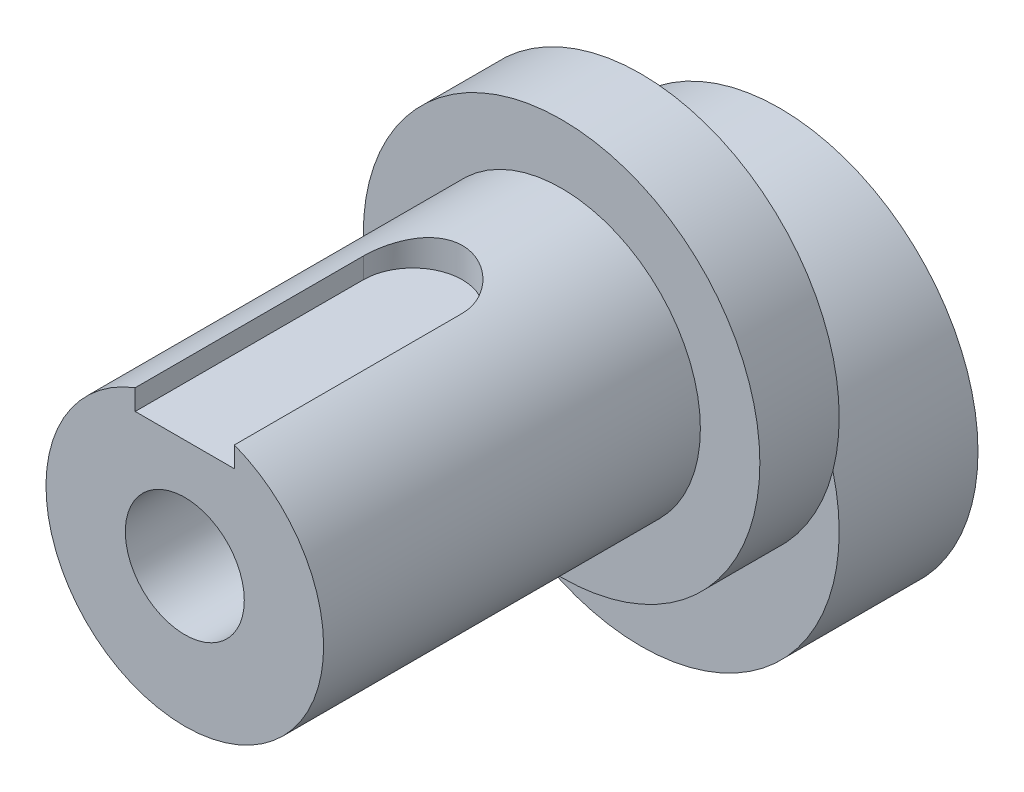
ISO-10303-21;
HEADER;
FILE_DESCRIPTION(('STEP AP214'),'2;1');
FILE_NAME('part.step','',(''),(''),'','','');
FILE_SCHEMA(('AUTOMOTIVE_DESIGN { 1 0 10303 214 1 1 1 1 }'));
ENDSEC;
DATA;
#1=APPLICATION_CONTEXT('core data for automotive mechanical design processes');
#2=APPLICATION_PROTOCOL_DEFINITION('international standard','automotive_design',2000,#1);
#3=PRODUCT_CONTEXT('',#1,'mechanical');
#4=PRODUCT('Part','Part','',(#3));
#5=PRODUCT_RELATED_PRODUCT_CATEGORY('part','',(#4));
#6=PRODUCT_DEFINITION_FORMATION('','',#4);
#7=PRODUCT_DEFINITION_CONTEXT('part definition',#1,'design');
#8=PRODUCT_DEFINITION('design','',#6,#7);
#9=PRODUCT_DEFINITION_SHAPE('','',#8);
#10=(LENGTH_UNIT() NAMED_UNIT(*) SI_UNIT(.MILLI.,.METRE.));
#11=(NAMED_UNIT(*) PLANE_ANGLE_UNIT() SI_UNIT($,.RADIAN.));
#12=(NAMED_UNIT(*) SI_UNIT($,.STERADIAN.) SOLID_ANGLE_UNIT());
#13=UNCERTAINTY_MEASURE_WITH_UNIT(LENGTH_MEASURE(1.E-05),#10,'distance_accuracy_value','');
#14=(GEOMETRIC_REPRESENTATION_CONTEXT(3) GLOBAL_UNCERTAINTY_ASSIGNED_CONTEXT((#13)) GLOBAL_UNIT_ASSIGNED_CONTEXT((#10,
#11,#12)) REPRESENTATION_CONTEXT('',''));
#15=CARTESIAN_POINT('',(0.,0.,0.));
#16=DIRECTION('',(0.,0.,1.));
#17=DIRECTION('',(1.,0.,0.));
#18=AXIS2_PLACEMENT_3D('',#15,#16,#17);
#19=CARTESIAN_POINT('',(0.,5.,11.));
#20=DIRECTION('',(0.,0.,1.));
#21=DIRECTION('',(1.,0.,0.));
#22=AXIS2_PLACEMENT_3D('',#19,#20,#21);
#23=PLANE('',#22);
#24=CARTESIAN_POINT('',(0.,5.,11.));
#25=DIRECTION('',(0.,0.,1.));
#26=DIRECTION('',(1.,0.,0.));
#27=AXIS2_PLACEMENT_3D('',#24,#25,#26);
#28=CIRCLE('',#27,10.);
#29=CARTESIAN_POINT('',(10.,5.,11.));
#30=VERTEX_POINT('',#29);
#31=EDGE_CURVE('E116',#30,#30,#28,.T.);
#32=ORIENTED_EDGE('',*,*,#31,.T.);
#33=EDGE_LOOP('',(#32));
#34=FACE_BOUND('',#33,.T.);
#35=CARTESIAN_POINT('',(0.,5.,11.));
#36=DIRECTION('',(0.,0.,1.));
#37=DIRECTION('',(1.,0.,0.));
#38=AXIS2_PLACEMENT_3D('',#35,#36,#37);
#39=CIRCLE('',#38,7.);
#40=CARTESIAN_POINT('',(7.,5.,11.));
#41=VERTEX_POINT('',#40);
#42=EDGE_CURVE('E109',#41,#41,#39,.T.);
#43=ORIENTED_EDGE('',*,*,#42,.F.);
#44=EDGE_LOOP('',(#43));
#45=FACE_BOUND('',#44,.T.);
#46=ADVANCED_FACE('F33',(#34,#45),#23,.T.);
#47=CARTESIAN_POINT('',(0.,0.,7.));
#48=DIRECTION('',(0.,0.,1.));
#49=DIRECTION('',(1.,0.,0.));
#50=AXIS2_PLACEMENT_3D('',#47,#48,#49);
#51=PLANE('',#50);
#52=CARTESIAN_POINT('',(0.,5.,7.));
#53=DIRECTION('',(0.,0.,1.));
#54=DIRECTION('',(1.,0.,0.));
#55=AXIS2_PLACEMENT_3D('',#52,#53,#54);
#56=CIRCLE('',#55,10.);
#57=CARTESIAN_POINT('',(-9.68245836551854,2.5,7.));
#58=VERTEX_POINT('',#57);
#59=CARTESIAN_POINT('',(9.68245836551854,2.5,7.));
#60=VERTEX_POINT('',#59);
#61=EDGE_CURVE('E55',#58,#60,#56,.T.);
#62=ORIENTED_EDGE('',*,*,#61,.F.);
#63=CARTESIAN_POINT('',(0.,0.,7.));
#64=DIRECTION('',(0.,0.,1.));
#65=DIRECTION('',(1.,0.,0.));
#66=AXIS2_PLACEMENT_3D('',#63,#64,#65);
#67=CIRCLE('',#66,10.);
#68=EDGE_CURVE('E128',#58,#60,#67,.T.);
#69=ORIENTED_EDGE('',*,*,#68,.T.);
#70=EDGE_LOOP('',(#62,#69));
#71=FACE_BOUND('',#70,.T.);
#72=ADVANCED_FACE('F164',(#71),#51,.T.);
#73=CARTESIAN_POINT('',(0.,0.,0.));
#74=DIRECTION('',(0.,0.,1.));
#75=DIRECTION('',(1.,0.,0.));
#76=AXIS2_PLACEMENT_3D('',#73,#74,#75);
#77=PLANE('',#76);
#78=CARTESIAN_POINT('',(0.,0.,0.));
#79=DIRECTION('',(0.,0.,1.));
#80=DIRECTION('',(1.,0.,0.));
#81=AXIS2_PLACEMENT_3D('',#78,#79,#80);
#82=CIRCLE('',#81,10.);
#83=CARTESIAN_POINT('',(10.,0.,0.));
#84=VERTEX_POINT('',#83);
#85=EDGE_CURVE('E123',#84,#84,#82,.T.);
#86=ORIENTED_EDGE('',*,*,#85,.F.);
#87=EDGE_LOOP('',(#86));
#88=FACE_BOUND('',#87,.T.);
#89=CARTESIAN_POINT('',(0.,5.,0.));
#90=DIRECTION('',(0.,0.,1.));
#91=DIRECTION('',(1.,0.,0.));
#92=AXIS2_PLACEMENT_3D('',#89,#90,#91);
#93=CIRCLE('',#92,3.);
#94=CARTESIAN_POINT('',(3.,5.,0.));
#95=VERTEX_POINT('',#94);
#96=EDGE_CURVE('E119',#95,#95,#93,.T.);
#97=ORIENTED_EDGE('',*,*,#96,.T.);
#98=EDGE_LOOP('',(#97));
#99=FACE_BOUND('',#98,.T.);
#100=ADVANCED_FACE('F169',(#88,#99),#77,.F.);
#101=CARTESIAN_POINT('',(0.,0.,7.));
#102=DIRECTION('',(0.,0.,-1.));
#103=DIRECTION('',(-1.,0.,0.));
#104=AXIS2_PLACEMENT_3D('',#101,#102,#103);
#105=CYLINDRICAL_SURFACE('',#104,10.);
#106=EDGE_CURVE('E124',#60,#58,#67,.T.);
#107=ORIENTED_EDGE('',*,*,#106,.F.);
#108=ORIENTED_EDGE('',*,*,#68,.F.);
#109=EDGE_LOOP('',(#107,#108));
#110=FACE_BOUND('',#109,.T.);
#111=ORIENTED_EDGE('',*,*,#85,.T.);
#112=EDGE_LOOP('',(#111));
#113=FACE_BOUND('',#112,.T.);
#114=ADVANCED_FACE('F35',(#110,#113),#105,.T.);
#115=CARTESIAN_POINT('',(0.,5.,7.));
#116=DIRECTION('',(0.,0.,-1.));
#117=DIRECTION('',(-1.,0.,0.));
#118=AXIS2_PLACEMENT_3D('',#115,#116,#117);
#119=CYLINDRICAL_SURFACE('',#118,3.);
#120=ORIENTED_EDGE('',*,*,#96,.F.);
#121=EDGE_LOOP('',(#120));
#122=FACE_BOUND('',#121,.T.);
#123=CARTESIAN_POINT('',(0.,5.,30.));
#124=DIRECTION('',(0.,0.,1.));
#125=DIRECTION('',(1.,0.,0.));
#126=AXIS2_PLACEMENT_3D('',#123,#124,#125);
#127=CIRCLE('',#126,3.);
#128=CARTESIAN_POINT('',(3.,5.,30.));
#129=VERTEX_POINT('',#128);
#130=EDGE_CURVE('E106',#129,#129,#127,.T.);
#131=ORIENTED_EDGE('',*,*,#130,.T.);
#132=EDGE_LOOP('',(#131));
#133=FACE_BOUND('',#132,.T.);
#134=ADVANCED_FACE('F174',(#122,#133),#119,.F.);
#135=CARTESIAN_POINT('',(0.,5.,7.));
#136=DIRECTION('',(0.,0.,1.));
#137=DIRECTION('',(1.,0.,0.));
#138=AXIS2_PLACEMENT_3D('',#135,#136,#137);
#139=PLANE('',#138);
#140=EDGE_CURVE('E113',#60,#58,#56,.T.);
#141=ORIENTED_EDGE('',*,*,#140,.F.);
#142=ORIENTED_EDGE('',*,*,#106,.T.);
#143=EDGE_LOOP('',(#141,#142));
#144=FACE_BOUND('',#143,.T.);
#145=ADVANCED_FACE('F159',(#144),#139,.F.);
#146=CARTESIAN_POINT('',(0.,5.,11.));
#147=DIRECTION('',(0.,0.,-1.));
#148=DIRECTION('',(-1.,0.,0.));
#149=AXIS2_PLACEMENT_3D('',#146,#147,#148);
#150=CYLINDRICAL_SURFACE('',#149,10.);
#151=ORIENTED_EDGE('',*,*,#31,.F.);
#152=EDGE_LOOP('',(#151));
#153=FACE_BOUND('',#152,.T.);
#154=ORIENTED_EDGE('',*,*,#61,.T.);
#155=ORIENTED_EDGE('',*,*,#140,.T.);
#156=EDGE_LOOP('',(#154,#155));
#157=FACE_BOUND('',#156,.T.);
#158=ADVANCED_FACE('F152',(#153,#157),#150,.T.);
#159=CARTESIAN_POINT('',(0.,5.,30.));
#160=DIRECTION('',(0.,0.,1.));
#161=DIRECTION('',(1.,0.,0.));
#162=AXIS2_PLACEMENT_3D('',#159,#160,#161);
#163=PLANE('',#162);
#164=DIRECTION('',(0.,1.,0.));
#165=VECTOR('',#164,1.);
#166=CARTESIAN_POINT('',(2.5,5.,30.));
#167=LINE('',#166,#165);
#168=CARTESIAN_POINT('',(2.5,10.5,30.));
#169=VERTEX_POINT('',#168);
#170=CARTESIAN_POINT('',(2.5,11.538348415311,30.));
#171=VERTEX_POINT('',#170);
#172=EDGE_CURVE('E104',#169,#171,#167,.T.);
#173=ORIENTED_EDGE('',*,*,#172,.F.);
#174=DIRECTION('',(-1.,0.,0.));
#175=VECTOR('',#174,1.);
#176=CARTESIAN_POINT('',(0.,10.5,30.));
#177=LINE('',#176,#175);
#178=CARTESIAN_POINT('',(-2.5,10.5,30.));
#179=VERTEX_POINT('',#178);
#180=EDGE_CURVE('E11',#169,#179,#177,.T.);
#181=ORIENTED_EDGE('',*,*,#180,.T.);
#182=DIRECTION('',(0.,-1.,0.));
#183=VECTOR('',#182,1.);
#184=CARTESIAN_POINT('',(-2.5,5.,30.));
#185=LINE('',#184,#183);
#186=CARTESIAN_POINT('',(-2.5,11.538348415311,30.));
#187=VERTEX_POINT('',#186);
#188=EDGE_CURVE('E101',#187,#179,#185,.T.);
#189=ORIENTED_EDGE('',*,*,#188,.F.);
#190=CARTESIAN_POINT('',(0.,5.,30.));
#191=DIRECTION('',(0.,0.,1.));
#192=DIRECTION('',(1.,0.,0.));
#193=AXIS2_PLACEMENT_3D('',#190,#191,#192);
#194=CIRCLE('',#193,7.);
#195=EDGE_CURVE('E110',#187,#171,#194,.T.);
#196=ORIENTED_EDGE('',*,*,#195,.T.);
#197=EDGE_LOOP('',(#173,#181,#189,#196));
#198=FACE_BOUND('',#197,.T.);
#199=ORIENTED_EDGE('',*,*,#130,.F.);
#200=EDGE_LOOP('',(#199));
#201=FACE_BOUND('',#200,.T.);
#202=ADVANCED_FACE('F150',(#198,#201),#163,.T.);
#203=CARTESIAN_POINT('',(0.,5.,30.));
#204=DIRECTION('',(0.,0.,-1.));
#205=DIRECTION('',(-1.,0.,0.));
#206=AXIS2_PLACEMENT_3D('',#203,#204,#205);
#207=CYLINDRICAL_SURFACE('',#206,7.);
#208=CARTESIAN_POINT('',(-2.5,11.538348415311,18.5));
#209=CARTESIAN_POINT('',(-2.50000932220903,11.5383365378513,18.4321107542711));
#210=CARTESIAN_POINT('',(-2.49723485076694,11.5394054992274,18.3642280673609));
#211=CARTESIAN_POINT('',(-2.4861910211816,11.5436165747813,18.2289960893886));
#212=CARTESIAN_POINT('',(-2.47792334551208,11.5467580541806,18.1616466413939));
#213=CARTESIAN_POINT('',(-2.456001752859,11.5550121763794,18.0281785853972));
#214=CARTESIAN_POINT('',(-2.44236559963955,11.5601183170568,17.9620566636602));
#215=CARTESIAN_POINT('',(-2.40985115466648,11.5721317785417,17.8312981648915));
#216=CARTESIAN_POINT('',(-2.39097263107435,11.5790391790075,17.7666616536876));
#217=CARTESIAN_POINT('',(-2.32673964179204,11.6021493436571,17.5757356335225));
#218=CARTESIAN_POINT('',(-2.27375112606986,11.6207547534084,17.4522095478644));
#219=CARTESIAN_POINT('',(-2.14910757865425,11.6622539736071,17.215769666872));
#220=CARTESIAN_POINT('',(-2.07743895048849,11.6851509042488,17.1028636832645));
#221=CARTESIAN_POINT('',(-1.9140257110197,11.7337991379222,16.8857847866473));
#222=CARTESIAN_POINT('',(-1.82158337146744,11.7596286404137,16.7821535248041));
#223=CARTESIAN_POINT('',(-1.6207338877633,11.8105759232303,16.5914912952836));
#224=CARTESIAN_POINT('',(-1.51232377552673,11.8356935701987,16.5044634207567));
#225=CARTESIAN_POINT('',(-1.27853915335934,11.8833113327905,16.346910144545));
#226=CARTESIAN_POINT('',(-1.15274833789185,11.905708352238,16.2769684781395));
#227=CARTESIAN_POINT('',(-0.890250825476635,11.9444235767263,16.1594633532026));
#228=CARTESIAN_POINT('',(-0.753547890540327,11.9607438658547,16.111892220954));
#229=CARTESIAN_POINT('',(-0.478829979256175,11.9849105051071,16.0423593978176));
#230=CARTESIAN_POINT('',(-0.341079835227466,11.9930659435251,16.0194608695289));
#231=CARTESIAN_POINT('',(-0.063464305296904,12.0010879805382,15.9969315972224));
#232=CARTESIAN_POINT('',(0.0764004845074477,12.000956873027,15.9972944139654));
#233=CARTESIAN_POINT('',(0.347593258486945,11.9926225804908,16.0207112737611));
#234=CARTESIAN_POINT('',(0.47902240707872,11.9847824358352,16.0427447941985));
#235=CARTESIAN_POINT('',(0.736175812143607,11.9623783250735,16.1071734241588));
#236=CARTESIAN_POINT('',(0.861899745780463,11.9478139789904,16.1495696843625));
#237=CARTESIAN_POINT('',(1.10616102429807,11.9131650689037,16.2540469115653));
#238=CARTESIAN_POINT('',(1.22457279066906,11.8930059216431,16.3163957149601));
#239=CARTESIAN_POINT('',(1.44953531305523,11.8492335561632,16.4587793352234));
#240=CARTESIAN_POINT('',(1.5560824517677,11.8256192895926,16.5388195237836));
#241=CARTESIAN_POINT('',(1.7603244525607,11.7759054780549,16.7193232636567));
#242=CARTESIAN_POINT('',(1.85724185700417,11.7497405584388,16.8206497231449));
#243=CARTESIAN_POINT('',(2.03299914621296,11.6989034246898,17.0383273641656));
#244=CARTESIAN_POINT('',(2.11183255456462,11.6742317476526,17.1546839051685));
#245=CARTESIAN_POINT('',(2.25049860898458,11.628778038754,17.401942598522));
#246=CARTESIAN_POINT('',(2.30994207989625,11.6080787511899,17.5330789755054));
#247=CARTESIAN_POINT('',(2.40555439725849,11.5738821361027,17.8043648015822));
#248=CARTESIAN_POINT('',(2.44176119399954,11.5603730716505,17.944499141169));
#249=CARTESIAN_POINT('',(2.47705497148627,11.5470854224556,18.1550305442642));
#250=CARTESIAN_POINT('',(2.48565347586445,11.5438201096791,18.2237363017718));
#251=CARTESIAN_POINT('',(2.49712352174882,11.5394491082968,18.3616151641917));
#252=CARTESIAN_POINT('',(2.50000139665367,11.5383410314094,18.4307876671005));
#253=CARTESIAN_POINT('',(2.5,11.538348415311,18.5));
#254=B_SPLINE_CURVE_WITH_KNOTS('',3,(#208,#209,#210,#211,#212,#213,#214,#215,#216,#217,#218,
#219,#220,#221,#222,#223,#224,#225,#226,#227,#228,#229,#230,#231,#232,#233,#234,#235,#236,#237,
#238,#239,#240,#241,#242,#243,#244,#245,#246,#247,#248,#249,#250,#251,#252,#253),.UNSPECIFIED.,
.F.,.F.,(4,2,2,2,2,2,2,2,2,2,2,2,2,2,2,2,2,2,2,2,2,2,4),(0.,0.203591628551589,0.407120929225528,
0.609982356545745,0.812852756635989,1.21793118555512,1.6233052814847,2.0451597231193,
2.4670926781184,2.90188398965561,3.33652604665238,3.75400993940861,4.17137826416922,
4.56998920861347,4.96862268086888,5.37284909448639,5.77719841367921,6.20315837945088,
6.62927065674721,7.06347329058504,7.49696496492444,7.70468580162772,7.91217653896403),.UNSPECIFIED.);
#255=CARTESIAN_POINT('',(-2.5,11.538348415311,18.5));
#256=VERTEX_POINT('',#255);
#257=CARTESIAN_POINT('',(2.5,11.538348415311,18.5));
#258=VERTEX_POINT('',#257);
#259=EDGE_CURVE('E127',#256,#258,#254,.T.);
#260=ORIENTED_EDGE('',*,*,#259,.T.);
#261=DIRECTION('',(0.,0.,-1.));
#262=VECTOR('',#261,1.);
#263=CARTESIAN_POINT('',(2.5,11.538348415311,30.));
#264=LINE('',#263,#262);
#265=EDGE_CURVE('E41',#258,#171,#264,.F.);
#266=ORIENTED_EDGE('',*,*,#265,.T.);
#267=ORIENTED_EDGE('',*,*,#195,.F.);
#268=DIRECTION('',(0.,0.,-1.));
#269=VECTOR('',#268,1.);
#270=CARTESIAN_POINT('',(-2.5,11.538348415311,30.));
#271=LINE('',#270,#269);
#272=EDGE_CURVE('E138',#187,#256,#271,.T.);
#273=ORIENTED_EDGE('',*,*,#272,.T.);
#274=EDGE_LOOP('',(#260,#266,#267,#273));
#275=FACE_BOUND('',#274,.T.);
#276=ORIENTED_EDGE('',*,*,#42,.T.);
#277=EDGE_LOOP('',(#276));
#278=FACE_BOUND('',#277,.T.);
#279=ADVANCED_FACE('F139',(#275,#278),#207,.T.);
#280=CARTESIAN_POINT('',(0.,10.5,18.5));
#281=DIRECTION('',(0.,1.,0.));
#282=DIRECTION('',(0.,0.,1.));
#283=AXIS2_PLACEMENT_3D('',#280,#281,#282);
#284=CYLINDRICAL_SURFACE('',#283,2.5);
#285=DIRECTION('',(0.,1.,0.));
#286=VECTOR('',#285,1.);
#287=CARTESIAN_POINT('',(-2.5,10.5,18.5));
#288=LINE('',#287,#286);
#289=CARTESIAN_POINT('',(-2.5,10.5,18.5));
#290=VERTEX_POINT('',#289);
#291=EDGE_CURVE('E92',#290,#256,#288,.T.);
#292=ORIENTED_EDGE('',*,*,#291,.F.);
#293=CARTESIAN_POINT('',(0.,10.5,18.5));
#294=DIRECTION('',(0.,1.,0.));
#295=DIRECTION('',(0.,0.,1.));
#296=AXIS2_PLACEMENT_3D('',#293,#294,#295);
#297=CIRCLE('',#296,2.5);
#298=CARTESIAN_POINT('',(2.5,10.5,18.5));
#299=VERTEX_POINT('',#298);
#300=EDGE_CURVE('E85',#299,#290,#297,.T.);
#301=ORIENTED_EDGE('',*,*,#300,.F.);
#302=DIRECTION('',(0.,1.,0.));
#303=VECTOR('',#302,1.);
#304=CARTESIAN_POINT('',(2.5,10.5,18.5));
#305=LINE('',#304,#303);
#306=EDGE_CURVE('E48',#299,#258,#305,.T.);
#307=ORIENTED_EDGE('',*,*,#306,.T.);
#308=ORIENTED_EDGE('',*,*,#259,.F.);
#309=EDGE_LOOP('',(#292,#301,#307,#308));
#310=FACE_BOUND('',#309,.T.);
#311=ADVANCED_FACE('F95',(#310),#284,.F.);
#312=CARTESIAN_POINT('',(2.5,10.5,44.));
#313=DIRECTION('',(1.,0.,0.));
#314=DIRECTION('',(0.,0.,-1.));
#315=AXIS2_PLACEMENT_3D('',#312,#313,#314);
#316=PLANE('',#315);
#317=ORIENTED_EDGE('',*,*,#172,.T.);
#318=ORIENTED_EDGE('',*,*,#265,.F.);
#319=ORIENTED_EDGE('',*,*,#306,.F.);
#320=DIRECTION('',(0.,0.,-1.));
#321=VECTOR('',#320,1.);
#322=CARTESIAN_POINT('',(2.5,10.5,44.));
#323=LINE('',#322,#321);
#324=EDGE_CURVE('E82',#169,#299,#323,.T.);
#325=ORIENTED_EDGE('',*,*,#324,.F.);
#326=EDGE_LOOP('',(#317,#318,#319,#325));
#327=FACE_BOUND('',#326,.T.);
#328=ADVANCED_FACE('F89',(#327),#316,.F.);
#329=CARTESIAN_POINT('',(-2.5,10.5,44.));
#330=DIRECTION('',(-1.,0.,0.));
#331=DIRECTION('',(0.,0.,1.));
#332=AXIS2_PLACEMENT_3D('',#329,#330,#331);
#333=PLANE('',#332);
#334=ORIENTED_EDGE('',*,*,#188,.T.);
#335=DIRECTION('',(0.,0.,1.));
#336=VECTOR('',#335,1.);
#337=CARTESIAN_POINT('',(-2.5,10.5,44.));
#338=LINE('',#337,#336);
#339=EDGE_CURVE('E93',#290,#179,#338,.T.);
#340=ORIENTED_EDGE('',*,*,#339,.F.);
#341=ORIENTED_EDGE('',*,*,#291,.T.);
#342=ORIENTED_EDGE('',*,*,#272,.F.);
#343=EDGE_LOOP('',(#334,#340,#341,#342));
#344=FACE_BOUND('',#343,.T.);
#345=ADVANCED_FACE('F147',(#344),#333,.F.);
#346=CARTESIAN_POINT('',(0.,10.5,18.5));
#347=DIRECTION('',(0.,1.,0.));
#348=DIRECTION('',(0.,0.,1.));
#349=AXIS2_PLACEMENT_3D('',#346,#347,#348);
#350=PLANE('',#349);
#351=ORIENTED_EDGE('',*,*,#324,.T.);
#352=ORIENTED_EDGE('',*,*,#300,.T.);
#353=ORIENTED_EDGE('',*,*,#339,.T.);
#354=ORIENTED_EDGE('',*,*,#180,.F.);
#355=EDGE_LOOP('',(#351,#352,#353,#354));
#356=FACE_BOUND('',#355,.T.);
#357=ADVANCED_FACE('F83',(#356),#350,.T.);
#358=CLOSED_SHELL('',(#46,#72,#100,#114,#134,#145,#158,#202,#279,#311,#328,#345,#357));
#359=MANIFOLD_SOLID_BREP('B2',#358);
#360=ADVANCED_BREP_SHAPE_REPRESENTATION('',(#18,#359),#14);
#361=SHAPE_DEFINITION_REPRESENTATION(#9,#360);
ENDSEC;
END-ISO-10303-21;
